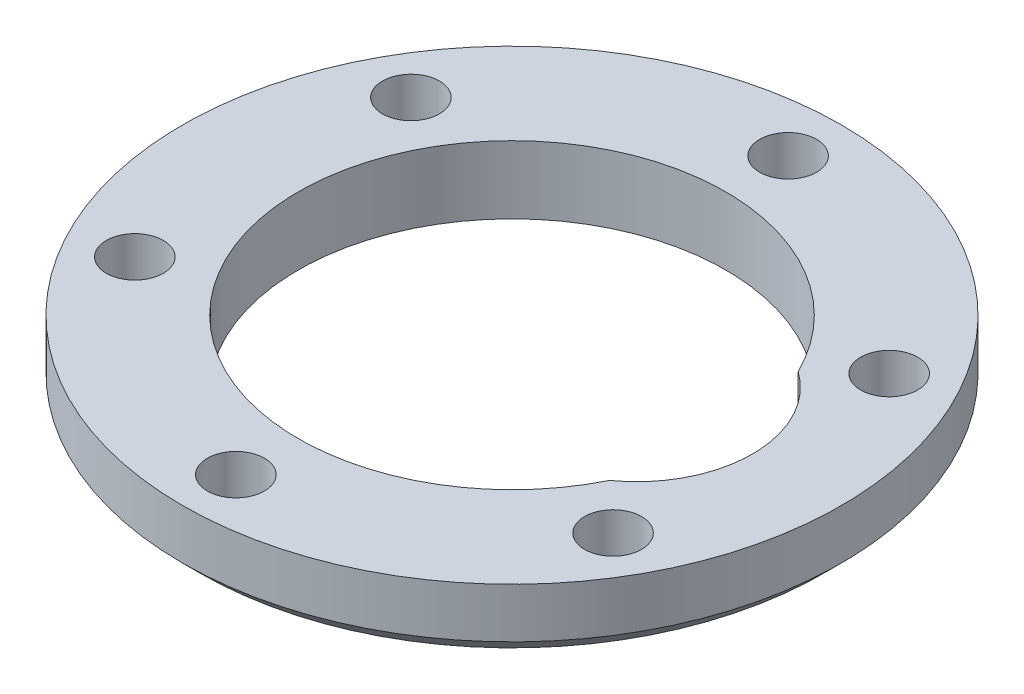
ISO-10303-21;
HEADER;
FILE_DESCRIPTION(('STEP AP214'),'2;1');
FILE_NAME('part.step','',(''),(''),'','','');
FILE_SCHEMA(('AUTOMOTIVE_DESIGN { 1 0 10303 214 1 1 1 1 }'));
ENDSEC;
DATA;
#1=APPLICATION_CONTEXT('core data for automotive mechanical design processes');
#2=APPLICATION_PROTOCOL_DEFINITION('international standard','automotive_design',2000,#1);
#3=PRODUCT_CONTEXT('',#1,'mechanical');
#4=PRODUCT('Part','Part','',(#3));
#5=PRODUCT_RELATED_PRODUCT_CATEGORY('part','',(#4));
#6=PRODUCT_DEFINITION_FORMATION('','',#4);
#7=PRODUCT_DEFINITION_CONTEXT('part definition',#1,'design');
#8=PRODUCT_DEFINITION('design','',#6,#7);
#9=PRODUCT_DEFINITION_SHAPE('','',#8);
#10=(LENGTH_UNIT() NAMED_UNIT(*) SI_UNIT(.MILLI.,.METRE.));
#11=(NAMED_UNIT(*) PLANE_ANGLE_UNIT() SI_UNIT($,.RADIAN.));
#12=(NAMED_UNIT(*) SI_UNIT($,.STERADIAN.) SOLID_ANGLE_UNIT());
#13=UNCERTAINTY_MEASURE_WITH_UNIT(LENGTH_MEASURE(1.E-05),#10,'distance_accuracy_value','');
#14=(GEOMETRIC_REPRESENTATION_CONTEXT(3) GLOBAL_UNCERTAINTY_ASSIGNED_CONTEXT((#13)) GLOBAL_UNIT_ASSIGNED_CONTEXT((#10,
#11,#12)) REPRESENTATION_CONTEXT('',''));
#15=CARTESIAN_POINT('',(0.,0.,0.));
#16=DIRECTION('',(0.,0.,1.));
#17=DIRECTION('',(1.,0.,0.));
#18=AXIS2_PLACEMENT_3D('',#15,#16,#17);
#19=CARTESIAN_POINT('',(0.,3.8,0.));
#20=DIRECTION('',(0.,1.,0.));
#21=DIRECTION('',(0.,0.,1.));
#22=AXIS2_PLACEMENT_3D('',#19,#20,#21);
#23=PLANE('',#22);
#24=CARTESIAN_POINT('',(13.4233937586589,3.8,-7.74999999999987));
#25=DIRECTION('',(0.,1.,0.));
#26=DIRECTION('',(0.,0.,1.));
#27=AXIS2_PLACEMENT_3D('',#24,#25,#26);
#28=CIRCLE('',#27,1.6);
#29=CARTESIAN_POINT('',(13.4233937586589,3.8,-6.14999999999988));
#30=VERTEX_POINT('',#29);
#31=EDGE_CURVE('E113',#30,#30,#28,.T.);
#32=ORIENTED_EDGE('',*,*,#31,.F.);
#33=EDGE_LOOP('',(#32));
#34=FACE_BOUND('',#33,.T.);
#35=CARTESIAN_POINT('',(-13.4233937586588,3.8,-7.75000000000006));
#36=DIRECTION('',(0.,1.,0.));
#37=DIRECTION('',(0.,0.,1.));
#38=AXIS2_PLACEMENT_3D('',#35,#36,#37);
#39=CIRCLE('',#38,1.6);
#40=CARTESIAN_POINT('',(-13.4233937586588,3.8,-6.15000000000006));
#41=VERTEX_POINT('',#40);
#42=EDGE_CURVE('E129',#41,#41,#39,.T.);
#43=ORIENTED_EDGE('',*,*,#42,.F.);
#44=EDGE_LOOP('',(#43));
#45=FACE_BOUND('',#44,.T.);
#46=CARTESIAN_POINT('',(0.,3.8,15.5));
#47=DIRECTION('',(0.,1.,0.));
#48=DIRECTION('',(0.,0.,1.));
#49=AXIS2_PLACEMENT_3D('',#46,#47,#48);
#50=CIRCLE('',#49,1.6);
#51=CARTESIAN_POINT('',(0.,3.8,17.1));
#52=VERTEX_POINT('',#51);
#53=EDGE_CURVE('E145',#52,#52,#50,.T.);
#54=ORIENTED_EDGE('',*,*,#53,.F.);
#55=EDGE_LOOP('',(#54));
#56=FACE_BOUND('',#55,.T.);
#57=CARTESIAN_POINT('',(0.,3.8,0.));
#58=DIRECTION('',(0.,1.,0.));
#59=DIRECTION('',(0.,0.,1.));
#60=AXIS2_PLACEMENT_3D('',#57,#58,#59);
#61=CIRCLE('',#60,18.5);
#62=CARTESIAN_POINT('',(0.,3.8,18.5));
#63=VERTEX_POINT('',#62);
#64=EDGE_CURVE('E149',#63,#63,#61,.T.);
#65=ORIENTED_EDGE('',*,*,#64,.T.);
#66=EDGE_LOOP('',(#65));
#67=FACE_BOUND('',#66,.T.);
#68=CARTESIAN_POINT('',(-13.4233937586588,3.8,7.74999999999997));
#69=DIRECTION('',(0.,1.,0.));
#70=DIRECTION('',(0.,0.,1.));
#71=AXIS2_PLACEMENT_3D('',#68,#69,#70);
#72=CIRCLE('',#71,1.6);
#73=CARTESIAN_POINT('',(-13.4233937586588,3.8,9.34999999999997));
#74=VERTEX_POINT('',#73);
#75=EDGE_CURVE('E137',#74,#74,#72,.T.);
#76=ORIENTED_EDGE('',*,*,#75,.F.);
#77=EDGE_LOOP('',(#76));
#78=FACE_BOUND('',#77,.T.);
#79=CARTESIAN_POINT('',(1.08655307615524E-13,3.8,-15.5));
#80=DIRECTION('',(0.,1.,0.));
#81=DIRECTION('',(0.,0.,1.));
#82=AXIS2_PLACEMENT_3D('',#79,#80,#81);
#83=CIRCLE('',#82,1.6);
#84=CARTESIAN_POINT('',(1.08655307615524E-13,3.8,-13.9));
#85=VERTEX_POINT('',#84);
#86=EDGE_CURVE('E121',#85,#85,#83,.T.);
#87=ORIENTED_EDGE('',*,*,#86,.F.);
#88=EDGE_LOOP('',(#87));
#89=FACE_BOUND('',#88,.T.);
#90=CARTESIAN_POINT('',(13.4233937586587,3.8,7.75000000000016));
#91=DIRECTION('',(0.,1.,0.));
#92=DIRECTION('',(0.,0.,1.));
#93=AXIS2_PLACEMENT_3D('',#90,#91,#92);
#94=CIRCLE('',#93,1.6);
#95=CARTESIAN_POINT('',(13.4233937586587,3.8,9.35000000000016));
#96=VERTEX_POINT('',#95);
#97=EDGE_CURVE('E105',#96,#96,#94,.T.);
#98=ORIENTED_EDGE('',*,*,#97,.F.);
#99=EDGE_LOOP('',(#98));
#100=FACE_BOUND('',#99,.T.);
#101=CARTESIAN_POINT('',(7.,3.8,0.));
#102=DIRECTION('',(0.,1.,0.));
#103=DIRECTION('',(0.,0.,1.));
#104=AXIS2_PLACEMENT_3D('',#101,#102,#103);
#105=CIRCLE('',#104,6.5);
#106=CARTESIAN_POINT('',(10.7678571428571,3.8,5.2965321249871));
#107=VERTEX_POINT('',#106);
#108=CARTESIAN_POINT('',(10.7678571428571,3.8,-5.2965321249871));
#109=VERTEX_POINT('',#108);
#110=EDGE_CURVE('E101',#107,#109,#105,.T.);
#111=ORIENTED_EDGE('',*,*,#110,.F.);
#112=CARTESIAN_POINT('',(0.,3.8,0.));
#113=DIRECTION('',(0.,1.,0.));
#114=DIRECTION('',(0.,0.,1.));
#115=AXIS2_PLACEMENT_3D('',#112,#113,#114);
#116=CIRCLE('',#115,12.);
#117=EDGE_CURVE('E86',#109,#107,#116,.T.);
#118=ORIENTED_EDGE('',*,*,#117,.F.);
#119=EDGE_LOOP('',(#111,#118));
#120=FACE_BOUND('',#119,.T.);
#121=ADVANCED_FACE('F52',(#34,#45,#56,#67,#78,#89,#100,#120),#23,.T.);
#122=CARTESIAN_POINT('',(0.,0.,0.));
#123=DIRECTION('',(0.,1.,0.));
#124=DIRECTION('',(0.,0.,1.));
#125=AXIS2_PLACEMENT_3D('',#122,#123,#124);
#126=PLANE('',#125);
#127=CARTESIAN_POINT('',(0.,0.,0.));
#128=DIRECTION('',(0.,1.,0.));
#129=DIRECTION('',(0.,0.,1.));
#130=AXIS2_PLACEMENT_3D('',#127,#128,#129);
#131=CIRCLE('',#130,17.5);
#132=CARTESIAN_POINT('',(0.,0.,17.5));
#133=VERTEX_POINT('',#132);
#134=EDGE_CURVE('E13',#133,#133,#131,.F.);
#135=ORIENTED_EDGE('',*,*,#134,.T.);
#136=EDGE_LOOP('',(#135));
#137=FACE_BOUND('',#136,.T.);
#138=CARTESIAN_POINT('',(13.4233937586587,0.,7.75000000000016));
#139=DIRECTION('',(0.,1.,0.));
#140=DIRECTION('',(0.,0.,1.));
#141=AXIS2_PLACEMENT_3D('',#138,#139,#140);
#142=CIRCLE('',#141,1.6);
#143=CARTESIAN_POINT('',(13.4233937586587,0.,9.35000000000016));
#144=VERTEX_POINT('',#143);
#145=EDGE_CURVE('E92',#144,#144,#142,.T.);
#146=ORIENTED_EDGE('',*,*,#145,.T.);
#147=EDGE_LOOP('',(#146));
#148=FACE_BOUND('',#147,.T.);
#149=CARTESIAN_POINT('',(13.4233937586589,0.,-7.74999999999987));
#150=DIRECTION('',(0.,1.,0.));
#151=DIRECTION('',(0.,0.,1.));
#152=AXIS2_PLACEMENT_3D('',#149,#150,#151);
#153=CIRCLE('',#152,1.6);
#154=CARTESIAN_POINT('',(13.4233937586589,0.,-6.14999999999988));
#155=VERTEX_POINT('',#154);
#156=EDGE_CURVE('E109',#155,#155,#153,.T.);
#157=ORIENTED_EDGE('',*,*,#156,.T.);
#158=EDGE_LOOP('',(#157));
#159=FACE_BOUND('',#158,.T.);
#160=CARTESIAN_POINT('',(1.08655307615524E-13,0.,-15.5));
#161=DIRECTION('',(0.,1.,0.));
#162=DIRECTION('',(0.,0.,1.));
#163=AXIS2_PLACEMENT_3D('',#160,#161,#162);
#164=CIRCLE('',#163,1.6);
#165=CARTESIAN_POINT('',(1.08655307615524E-13,0.,-13.9));
#166=VERTEX_POINT('',#165);
#167=EDGE_CURVE('E117',#166,#166,#164,.T.);
#168=ORIENTED_EDGE('',*,*,#167,.T.);
#169=EDGE_LOOP('',(#168));
#170=FACE_BOUND('',#169,.T.);
#171=CARTESIAN_POINT('',(-13.4233937586588,0.,-7.75000000000006));
#172=DIRECTION('',(0.,1.,0.));
#173=DIRECTION('',(0.,0.,1.));
#174=AXIS2_PLACEMENT_3D('',#171,#172,#173);
#175=CIRCLE('',#174,1.6);
#176=CARTESIAN_POINT('',(-13.4233937586588,0.,-6.15000000000006));
#177=VERTEX_POINT('',#176);
#178=EDGE_CURVE('E125',#177,#177,#175,.T.);
#179=ORIENTED_EDGE('',*,*,#178,.T.);
#180=EDGE_LOOP('',(#179));
#181=FACE_BOUND('',#180,.T.);
#182=CARTESIAN_POINT('',(-13.4233937586588,0.,7.74999999999997));
#183=DIRECTION('',(0.,1.,0.));
#184=DIRECTION('',(0.,0.,1.));
#185=AXIS2_PLACEMENT_3D('',#182,#183,#184);
#186=CIRCLE('',#185,1.6);
#187=CARTESIAN_POINT('',(-13.4233937586588,0.,9.34999999999997));
#188=VERTEX_POINT('',#187);
#189=EDGE_CURVE('E133',#188,#188,#186,.T.);
#190=ORIENTED_EDGE('',*,*,#189,.T.);
#191=EDGE_LOOP('',(#190));
#192=FACE_BOUND('',#191,.T.);
#193=CARTESIAN_POINT('',(0.,0.,15.5));
#194=DIRECTION('',(0.,1.,0.));
#195=DIRECTION('',(0.,0.,1.));
#196=AXIS2_PLACEMENT_3D('',#193,#194,#195);
#197=CIRCLE('',#196,1.6);
#198=CARTESIAN_POINT('',(0.,0.,17.1));
#199=VERTEX_POINT('',#198);
#200=EDGE_CURVE('E141',#199,#199,#197,.T.);
#201=ORIENTED_EDGE('',*,*,#200,.T.);
#202=EDGE_LOOP('',(#201));
#203=FACE_BOUND('',#202,.T.);
#204=CARTESIAN_POINT('',(0.,0.,0.));
#205=DIRECTION('',(0.,1.,0.));
#206=DIRECTION('',(0.,0.,1.));
#207=AXIS2_PLACEMENT_3D('',#204,#205,#206);
#208=CIRCLE('',#207,12.);
#209=CARTESIAN_POINT('',(10.7678571428571,0.,-5.2965321249871));
#210=VERTEX_POINT('',#209);
#211=CARTESIAN_POINT('',(10.7678571428571,0.,5.2965321249871));
#212=VERTEX_POINT('',#211);
#213=EDGE_CURVE('E75',#210,#212,#208,.T.);
#214=ORIENTED_EDGE('',*,*,#213,.T.);
#215=CARTESIAN_POINT('',(7.,0.,0.));
#216=DIRECTION('',(0.,1.,0.));
#217=DIRECTION('',(0.,0.,1.));
#218=AXIS2_PLACEMENT_3D('',#215,#216,#217);
#219=CIRCLE('',#218,6.5);
#220=EDGE_CURVE('E81',#212,#210,#219,.T.);
#221=ORIENTED_EDGE('',*,*,#220,.T.);
#222=EDGE_LOOP('',(#214,#221));
#223=FACE_BOUND('',#222,.T.);
#224=ADVANCED_FACE('F94',(#137,#148,#159,#170,#181,#192,#203,#223),#126,.F.);
#225=CARTESIAN_POINT('',(0.,3.8,0.));
#226=DIRECTION('',(0.,-1.,0.));
#227=DIRECTION('',(0.,0.,-1.));
#228=AXIS2_PLACEMENT_3D('',#225,#226,#227);
#229=CYLINDRICAL_SURFACE('',#228,18.5);
#230=CARTESIAN_POINT('',(0.,1.00000000000003,0.));
#231=DIRECTION('',(0.,1.,0.));
#232=DIRECTION('',(0.,0.,1.));
#233=AXIS2_PLACEMENT_3D('',#230,#231,#232);
#234=CIRCLE('',#233,18.5);
#235=CARTESIAN_POINT('',(0.,1.00000000000003,18.5));
#236=VERTEX_POINT('',#235);
#237=EDGE_CURVE('E61',#236,#236,#234,.T.);
#238=ORIENTED_EDGE('',*,*,#237,.T.);
#239=EDGE_LOOP('',(#238));
#240=FACE_BOUND('',#239,.T.);
#241=ORIENTED_EDGE('',*,*,#64,.F.);
#242=EDGE_LOOP('',(#241));
#243=FACE_BOUND('',#242,.T.);
#244=ADVANCED_FACE('F162',(#240,#243),#229,.T.);
#245=CARTESIAN_POINT('',(0.,3.8,15.5));
#246=DIRECTION('',(0.,-1.,0.));
#247=DIRECTION('',(0.,0.,-1.));
#248=AXIS2_PLACEMENT_3D('',#245,#246,#247);
#249=CYLINDRICAL_SURFACE('',#248,1.6);
#250=ORIENTED_EDGE('',*,*,#53,.T.);
#251=EDGE_LOOP('',(#250));
#252=FACE_BOUND('',#251,.T.);
#253=ORIENTED_EDGE('',*,*,#200,.F.);
#254=EDGE_LOOP('',(#253));
#255=FACE_BOUND('',#254,.T.);
#256=ADVANCED_FACE('F183',(#252,#255),#249,.F.);
#257=CARTESIAN_POINT('',(-13.4233937586588,3.8,7.74999999999997));
#258=DIRECTION('',(0.,-1.,0.));
#259=DIRECTION('',(0.,0.,-1.));
#260=AXIS2_PLACEMENT_3D('',#257,#258,#259);
#261=CYLINDRICAL_SURFACE('',#260,1.6);
#262=ORIENTED_EDGE('',*,*,#75,.T.);
#263=EDGE_LOOP('',(#262));
#264=FACE_BOUND('',#263,.T.);
#265=ORIENTED_EDGE('',*,*,#189,.F.);
#266=EDGE_LOOP('',(#265));
#267=FACE_BOUND('',#266,.T.);
#268=ADVANCED_FACE('F189',(#264,#267),#261,.F.);
#269=CARTESIAN_POINT('',(-13.4233937586588,3.8,-7.75000000000006));
#270=DIRECTION('',(0.,-1.,0.));
#271=DIRECTION('',(0.,0.,-1.));
#272=AXIS2_PLACEMENT_3D('',#269,#270,#271);
#273=CYLINDRICAL_SURFACE('',#272,1.6);
#274=ORIENTED_EDGE('',*,*,#42,.T.);
#275=EDGE_LOOP('',(#274));
#276=FACE_BOUND('',#275,.T.);
#277=ORIENTED_EDGE('',*,*,#178,.F.);
#278=EDGE_LOOP('',(#277));
#279=FACE_BOUND('',#278,.T.);
#280=ADVANCED_FACE('F194',(#276,#279),#273,.F.);
#281=CARTESIAN_POINT('',(1.08655307615524E-13,3.8,-15.5));
#282=DIRECTION('',(0.,-1.,0.));
#283=DIRECTION('',(0.,0.,-1.));
#284=AXIS2_PLACEMENT_3D('',#281,#282,#283);
#285=CYLINDRICAL_SURFACE('',#284,1.6);
#286=ORIENTED_EDGE('',*,*,#86,.T.);
#287=EDGE_LOOP('',(#286));
#288=FACE_BOUND('',#287,.T.);
#289=ORIENTED_EDGE('',*,*,#167,.F.);
#290=EDGE_LOOP('',(#289));
#291=FACE_BOUND('',#290,.T.);
#292=ADVANCED_FACE('F265',(#288,#291),#285,.F.);
#293=CARTESIAN_POINT('',(13.4233937586589,3.8,-7.74999999999987));
#294=DIRECTION('',(0.,-1.,0.));
#295=DIRECTION('',(0.,0.,-1.));
#296=AXIS2_PLACEMENT_3D('',#293,#294,#295);
#297=CYLINDRICAL_SURFACE('',#296,1.6);
#298=ORIENTED_EDGE('',*,*,#31,.T.);
#299=EDGE_LOOP('',(#298));
#300=FACE_BOUND('',#299,.T.);
#301=ORIENTED_EDGE('',*,*,#156,.F.);
#302=EDGE_LOOP('',(#301));
#303=FACE_BOUND('',#302,.T.);
#304=ADVANCED_FACE('F274',(#300,#303),#297,.F.);
#305=CARTESIAN_POINT('',(13.4233937586587,3.8,7.75000000000016));
#306=DIRECTION('',(0.,-1.,0.));
#307=DIRECTION('',(0.,0.,-1.));
#308=AXIS2_PLACEMENT_3D('',#305,#306,#307);
#309=CYLINDRICAL_SURFACE('',#308,1.6);
#310=ORIENTED_EDGE('',*,*,#97,.T.);
#311=EDGE_LOOP('',(#310));
#312=FACE_BOUND('',#311,.T.);
#313=ORIENTED_EDGE('',*,*,#145,.F.);
#314=EDGE_LOOP('',(#313));
#315=FACE_BOUND('',#314,.T.);
#316=ADVANCED_FACE('F283',(#312,#315),#309,.F.);
#317=CARTESIAN_POINT('',(0.,3.8,0.));
#318=DIRECTION('',(0.,-1.,0.));
#319=DIRECTION('',(0.,0.,-1.));
#320=AXIS2_PLACEMENT_3D('',#317,#318,#319);
#321=CYLINDRICAL_SURFACE('',#320,12.);
#322=ORIENTED_EDGE('',*,*,#213,.F.);
#323=DIRECTION('',(0.,-1.,0.));
#324=VECTOR('',#323,1.);
#325=CARTESIAN_POINT('',(10.7678571428571,3.8,-5.2965321249871));
#326=LINE('',#325,#324);
#327=EDGE_CURVE('E83',#109,#210,#326,.T.);
#328=ORIENTED_EDGE('',*,*,#327,.F.);
#329=ORIENTED_EDGE('',*,*,#117,.T.);
#330=DIRECTION('',(0.,-1.,0.));
#331=VECTOR('',#330,1.);
#332=CARTESIAN_POINT('',(10.7678571428571,3.8,5.2965321249871));
#333=LINE('',#332,#331);
#334=EDGE_CURVE('E68',#107,#212,#333,.T.);
#335=ORIENTED_EDGE('',*,*,#334,.T.);
#336=EDGE_LOOP('',(#322,#328,#329,#335));
#337=FACE_BOUND('',#336,.T.);
#338=ADVANCED_FACE('F88',(#337),#321,.F.);
#339=CARTESIAN_POINT('',(7.,3.8,0.));
#340=DIRECTION('',(0.,-1.,0.));
#341=DIRECTION('',(0.,0.,-1.));
#342=AXIS2_PLACEMENT_3D('',#339,#340,#341);
#343=CYLINDRICAL_SURFACE('',#342,6.5);
#344=ORIENTED_EDGE('',*,*,#220,.F.);
#345=ORIENTED_EDGE('',*,*,#334,.F.);
#346=ORIENTED_EDGE('',*,*,#110,.T.);
#347=ORIENTED_EDGE('',*,*,#327,.T.);
#348=EDGE_LOOP('',(#344,#345,#346,#347));
#349=FACE_BOUND('',#348,.T.);
#350=ADVANCED_FACE('F82',(#349),#343,.F.);
#351=CARTESIAN_POINT('',(0.,1.00000000000003,0.));
#352=DIRECTION('',(0.,1.,0.));
#353=DIRECTION('',(0.,0.,1.));
#354=AXIS2_PLACEMENT_3D('',#351,#352,#353);
#355=CONICAL_SURFACE('',#354,18.5,0.785398163397452);
#356=ORIENTED_EDGE('',*,*,#134,.F.);
#357=EDGE_LOOP('',(#356));
#358=FACE_BOUND('',#357,.T.);
#359=ORIENTED_EDGE('',*,*,#237,.F.);
#360=EDGE_LOOP('',(#359));
#361=FACE_BOUND('',#360,.T.);
#362=ADVANCED_FACE('F54',(#358,#361),#355,.T.);
#363=CLOSED_SHELL('',(#121,#224,#244,#256,#268,#280,#292,#304,#316,#338,#350,#362));
#364=MANIFOLD_SOLID_BREP('B2',#363);
#365=ADVANCED_BREP_SHAPE_REPRESENTATION('',(#18,#364),#14);
#366=SHAPE_DEFINITION_REPRESENTATION(#9,#365);
ENDSEC;
END-ISO-10303-21;
